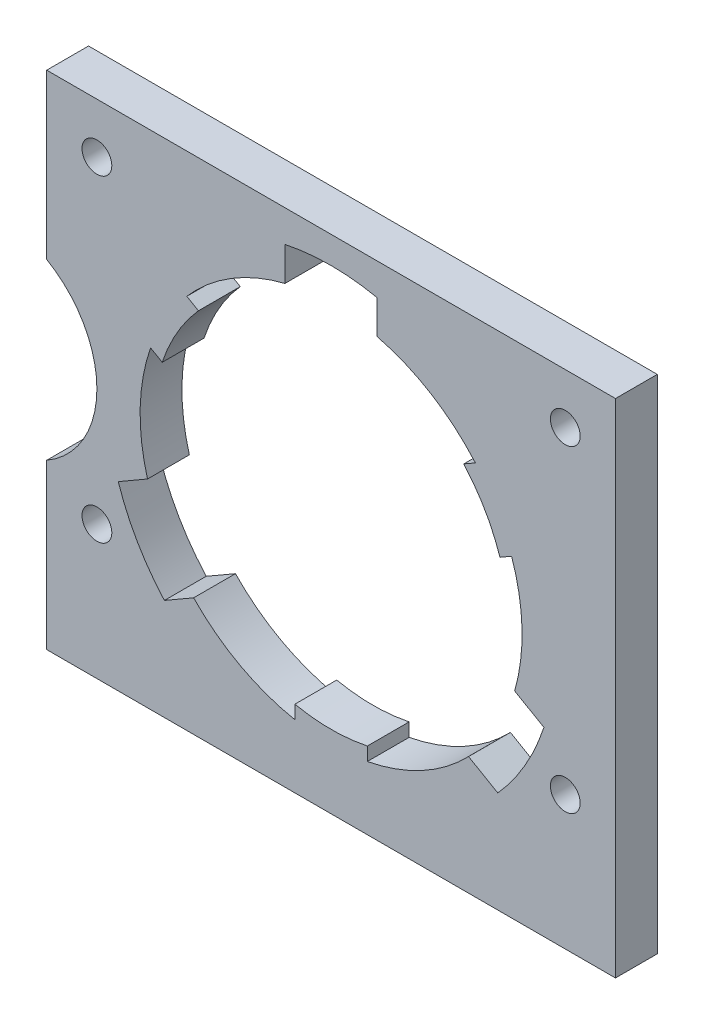
ISO-10303-21;
HEADER;
FILE_DESCRIPTION(('STEP AP214'),'2;1');
FILE_NAME('part.step','',(''),(''),'','','');
FILE_SCHEMA(('AUTOMOTIVE_DESIGN { 1 0 10303 214 1 1 1 1 }'));
ENDSEC;
DATA;
#1=APPLICATION_CONTEXT('core data for automotive mechanical design processes');
#2=APPLICATION_PROTOCOL_DEFINITION('international standard','automotive_design',2000,#1);
#3=PRODUCT_CONTEXT('',#1,'mechanical');
#4=PRODUCT('Part','Part','',(#3));
#5=PRODUCT_RELATED_PRODUCT_CATEGORY('part','',(#4));
#6=PRODUCT_DEFINITION_FORMATION('','',#4);
#7=PRODUCT_DEFINITION_CONTEXT('part definition',#1,'design');
#8=PRODUCT_DEFINITION('design','',#6,#7);
#9=PRODUCT_DEFINITION_SHAPE('','',#8);
#10=(LENGTH_UNIT() NAMED_UNIT(*) SI_UNIT(.MILLI.,.METRE.));
#11=(NAMED_UNIT(*) PLANE_ANGLE_UNIT() SI_UNIT($,.RADIAN.));
#12=(NAMED_UNIT(*) SI_UNIT($,.STERADIAN.) SOLID_ANGLE_UNIT());
#13=UNCERTAINTY_MEASURE_WITH_UNIT(LENGTH_MEASURE(1.E-05),#10,'distance_accuracy_value','');
#14=(GEOMETRIC_REPRESENTATION_CONTEXT(3) GLOBAL_UNCERTAINTY_ASSIGNED_CONTEXT((#13)) GLOBAL_UNIT_ASSIGNED_CONTEXT((#10,
#11,#12)) REPRESENTATION_CONTEXT('',''));
#15=CARTESIAN_POINT('',(0.,0.,0.));
#16=DIRECTION('',(0.,0.,1.));
#17=DIRECTION('',(1.,0.,0.));
#18=AXIS2_PLACEMENT_3D('',#15,#16,#17);
#19=CARTESIAN_POINT('',(0.,0.,3.175));
#20=DIRECTION('',(0.,0.,1.));
#21=DIRECTION('',(1.,0.,0.));
#22=AXIS2_PLACEMENT_3D('',#19,#20,#21);
#23=PLANE('',#22);
#24=CARTESIAN_POINT('',(17.78,15.24,3.175));
#25=DIRECTION('',(0.,0.,-1.));
#26=DIRECTION('',(-1.,0.,0.));
#27=AXIS2_PLACEMENT_3D('',#24,#25,#26);
#28=CIRCLE('',#27,1.1303);
#29=CARTESIAN_POINT('',(16.6497,15.24,3.175));
#30=VERTEX_POINT('',#29);
#31=EDGE_CURVE('E473',#30,#30,#28,.T.);
#32=ORIENTED_EDGE('',*,*,#31,.T.);
#33=EDGE_LOOP('',(#32));
#34=FACE_BOUND('',#33,.T.);
#35=CARTESIAN_POINT('',(17.78,-8.89,3.175));
#36=DIRECTION('',(0.,0.,-1.));
#37=DIRECTION('',(-1.,0.,0.));
#38=AXIS2_PLACEMENT_3D('',#35,#36,#37);
#39=CIRCLE('',#38,1.1303);
#40=CARTESIAN_POINT('',(16.6497,-8.89,3.175));
#41=VERTEX_POINT('',#40);
#42=EDGE_CURVE('E467',#41,#41,#39,.T.);
#43=ORIENTED_EDGE('',*,*,#42,.T.);
#44=EDGE_LOOP('',(#43));
#45=FACE_BOUND('',#44,.T.);
#46=CARTESIAN_POINT('',(-17.78,-8.89,3.175));
#47=DIRECTION('',(0.,0.,-1.));
#48=DIRECTION('',(-1.,0.,0.));
#49=AXIS2_PLACEMENT_3D('',#46,#47,#48);
#50=CIRCLE('',#49,1.1303);
#51=CARTESIAN_POINT('',(-18.9103,-8.89,3.175));
#52=VERTEX_POINT('',#51);
#53=EDGE_CURVE('E461',#52,#52,#50,.T.);
#54=ORIENTED_EDGE('',*,*,#53,.T.);
#55=EDGE_LOOP('',(#54));
#56=FACE_BOUND('',#55,.T.);
#57=DIRECTION('',(0.866025403784443,-0.499999999999992,0.));
#58=VECTOR('',#57,1.);
#59=CARTESIAN_POINT('',(12.657029534224,-11.3489912930525,3.175));
#60=LINE('',#59,#58);
#61=CARTESIAN_POINT('',(10.436057606954,-10.0667125529806,3.175));
#62=VERTEX_POINT('',#61);
#63=CARTESIAN_POINT('',(12.657029534224,-11.3489912930525,3.175));
#64=VERTEX_POINT('',#63);
#65=EDGE_CURVE('E359',#62,#64,#60,.T.);
#66=ORIENTED_EDGE('',*,*,#65,.F.);
#67=CARTESIAN_POINT('',(0.,0.,3.175));
#68=DIRECTION('',(0.,0.,1.));
#69=DIRECTION('',(1.,0.,0.));
#70=AXIS2_PLACEMENT_3D('',#67,#68,#69);
#71=CIRCLE('',#70,14.5);
#72=CARTESIAN_POINT('',(2.74999999999986,-14.2368360249039,3.175));
#73=VERTEX_POINT('',#72);
#74=EDGE_CURVE('E518',#73,#62,#71,.T.);
#75=ORIENTED_EDGE('',*,*,#74,.F.);
#76=DIRECTION('',(0.,1.,0.));
#77=VECTOR('',#76,1.);
#78=CARTESIAN_POINT('',(2.74999999999987,-13.2169398878863,3.175));
#79=LINE('',#78,#77);
#80=CARTESIAN_POINT('',(2.74999999999987,-13.2169398878863,3.175));
#81=VERTEX_POINT('',#80);
#82=EDGE_CURVE('E385',#73,#81,#79,.T.);
#83=ORIENTED_EDGE('',*,*,#82,.T.);
#84=CARTESIAN_POINT('',(0.,0.,3.175));
#85=DIRECTION('',(0.,0.,-1.));
#86=DIRECTION('',(1.,0.,0.));
#87=AXIS2_PLACEMENT_3D('',#84,#85,#86);
#88=CIRCLE('',#87,13.5);
#89=CARTESIAN_POINT('',(-2.75000000000013,-13.2169398878863,3.175));
#90=VERTEX_POINT('',#89);
#91=EDGE_CURVE('E392',#81,#90,#88,.T.);
#92=ORIENTED_EDGE('',*,*,#91,.T.);
#93=DIRECTION('',(0.,-1.,0.));
#94=VECTOR('',#93,1.);
#95=CARTESIAN_POINT('',(-2.75000000000013,-13.2169398878863,3.175));
#96=LINE('',#95,#94);
#97=CARTESIAN_POINT('',(-2.75000000000013,-14.2368360249038,3.175));
#98=VERTEX_POINT('',#97);
#99=EDGE_CURVE('E389',#90,#98,#96,.T.);
#100=ORIENTED_EDGE('',*,*,#99,.T.);
#101=CARTESIAN_POINT('',(-10.4360576069539,-10.0667125529807,3.175));
#102=VERTEX_POINT('',#101);
#103=EDGE_CURVE('E291',#102,#98,#71,.T.);
#104=ORIENTED_EDGE('',*,*,#103,.F.);
#105=DIRECTION('',(0.866025403784436,0.500000000000004,0.));
#106=VECTOR('',#105,1.);
#107=CARTESIAN_POINT('',(-12.6570295342239,-11.3489912930527,3.175));
#108=LINE('',#107,#106);
#109=CARTESIAN_POINT('',(-12.6570295342239,-11.3489912930527,3.175));
#110=VERTEX_POINT('',#109);
#111=EDGE_CURVE('E336',#110,#102,#108,.T.);
#112=ORIENTED_EDGE('',*,*,#111,.F.);
#113=CARTESIAN_POINT('',(0.,0.,3.175));
#114=DIRECTION('',(0.,0.,1.));
#115=DIRECTION('',(-0.500000000000004,0.866025403784436,0.));
#116=AXIS2_PLACEMENT_3D('',#113,#114,#115);
#117=CIRCLE('',#116,17.);
#118=CARTESIAN_POINT('',(-16.1570295342239,-5.2868134665616,3.175));
#119=VERTEX_POINT('',#118);
#120=EDGE_CURVE('E338',#119,#110,#117,.T.);
#121=ORIENTED_EDGE('',*,*,#120,.F.);
#122=DIRECTION('',(-0.866025403784436,-0.500000000000004,0.));
#123=VECTOR('',#122,1.);
#124=CARTESIAN_POINT('',(-16.1570295342239,-5.2868134665616,3.175));
#125=LINE('',#124,#123);
#126=CARTESIAN_POINT('',(-13.9360576069539,-4.00453472648967,3.175));
#127=VERTEX_POINT('',#126);
#128=EDGE_CURVE('E332',#127,#119,#125,.T.);
#129=ORIENTED_EDGE('',*,*,#128,.F.);
#130=CARTESIAN_POINT('',(-13.7044616670802,4.73684815204472,3.175));
#131=VERTEX_POINT('',#130);
#132=EDGE_CURVE('E290',#131,#127,#71,.T.);
#133=ORIENTED_EDGE('',*,*,#132,.F.);
#134=DIRECTION('',(0.866025403784443,-0.499999999999992,0.));
#135=VECTOR('',#134,1.);
#136=CARTESIAN_POINT('',(-12.8212057032014,4.22690008353595,3.175));
#137=LINE('',#136,#135);
#138=CARTESIAN_POINT('',(-12.8212057032014,4.22690008353595,3.175));
#139=VERTEX_POINT('',#138);
#140=EDGE_CURVE('E438',#131,#139,#137,.T.);
#141=ORIENTED_EDGE('',*,*,#140,.T.);
#142=CARTESIAN_POINT('',(0.,0.,3.175));
#143=DIRECTION('',(0.,0.,-1.));
#144=DIRECTION('',(-0.499999999999992,-0.866025403784443,0.));
#145=AXIS2_PLACEMENT_3D('',#142,#143,#144);
#146=CIRCLE('',#145,13.5);
#147=CARTESIAN_POINT('',(-10.0712057032014,8.99003980435036,3.175));
#148=VERTEX_POINT('',#147);
#149=EDGE_CURVE('E445',#139,#148,#146,.T.);
#150=ORIENTED_EDGE('',*,*,#149,.T.);
#151=DIRECTION('',(-0.866025403784443,0.499999999999992,0.));
#152=VECTOR('',#151,1.);
#153=CARTESIAN_POINT('',(-10.0712057032014,8.99003980435036,3.175));
#154=LINE('',#153,#152);
#155=CARTESIAN_POINT('',(-10.9544616670802,9.49998787285913,3.175));
#156=VERTEX_POINT('',#155);
#157=EDGE_CURVE('E442',#148,#156,#154,.T.);
#158=ORIENTED_EDGE('',*,*,#157,.T.);
#159=CARTESIAN_POINT('',(-3.49999999999999,14.0712472794703,3.175));
#160=VERTEX_POINT('',#159);
#161=EDGE_CURVE('E287',#160,#156,#71,.T.);
#162=ORIENTED_EDGE('',*,*,#161,.F.);
#163=DIRECTION('',(0.,-1.,0.));
#164=VECTOR('',#163,1.);
#165=CARTESIAN_POINT('',(-3.5,16.6358047596141,3.175));
#166=LINE('',#165,#164);
#167=CARTESIAN_POINT('',(-3.5,16.6358047596141,3.175));
#168=VERTEX_POINT('',#167);
#169=EDGE_CURVE('E309',#168,#160,#166,.T.);
#170=ORIENTED_EDGE('',*,*,#169,.F.);
#171=CARTESIAN_POINT('',(0.,0.,3.175));
#172=DIRECTION('',(0.,0.,1.));
#173=DIRECTION('',(1.,0.,0.));
#174=AXIS2_PLACEMENT_3D('',#171,#172,#173);
#175=CIRCLE('',#174,17.);
#176=CARTESIAN_POINT('',(3.5,16.6358047596141,3.175));
#177=VERTEX_POINT('',#176);
#178=EDGE_CURVE('E311',#177,#168,#175,.T.);
#179=ORIENTED_EDGE('',*,*,#178,.F.);
#180=DIRECTION('',(0.,1.,0.));
#181=VECTOR('',#180,1.);
#182=CARTESIAN_POINT('',(3.5,16.6358047596141,3.175));
#183=LINE('',#182,#181);
#184=CARTESIAN_POINT('',(3.5,14.0712472794703,3.175));
#185=VERTEX_POINT('',#184);
#186=EDGE_CURVE('E305',#185,#177,#183,.T.);
#187=ORIENTED_EDGE('',*,*,#186,.F.);
#188=CARTESIAN_POINT('',(10.9544616670802,9.49998787285908,3.175));
#189=VERTEX_POINT('',#188);
#190=EDGE_CURVE('E304',#189,#185,#71,.T.);
#191=ORIENTED_EDGE('',*,*,#190,.F.);
#192=DIRECTION('',(-0.866025403784436,-0.500000000000004,0.));
#193=VECTOR('',#192,1.);
#194=CARTESIAN_POINT('',(10.0712057032014,8.99003980435031,3.175));
#195=LINE('',#194,#193);
#196=CARTESIAN_POINT('',(10.0712057032014,8.99003980435031,3.175));
#197=VERTEX_POINT('',#196);
#198=EDGE_CURVE('E412',#189,#197,#195,.T.);
#199=ORIENTED_EDGE('',*,*,#198,.T.);
#200=CARTESIAN_POINT('',(0.,0.,3.175));
#201=DIRECTION('',(0.,0.,-1.));
#202=DIRECTION('',(-0.500000000000004,0.866025403784436,0.));
#203=AXIS2_PLACEMENT_3D('',#200,#201,#202);
#204=CIRCLE('',#203,13.5);
#205=CARTESIAN_POINT('',(12.8212057032014,4.22690008353588,3.175));
#206=VERTEX_POINT('',#205);
#207=EDGE_CURVE('E419',#197,#206,#204,.T.);
#208=ORIENTED_EDGE('',*,*,#207,.T.);
#209=DIRECTION('',(0.866025403784436,0.500000000000004,0.));
#210=VECTOR('',#209,1.);
#211=CARTESIAN_POINT('',(12.8212057032014,4.22690008353588,3.175));
#212=LINE('',#211,#210);
#213=CARTESIAN_POINT('',(13.7044616670802,4.73684815204466,3.175));
#214=VERTEX_POINT('',#213);
#215=EDGE_CURVE('E416',#206,#214,#212,.T.);
#216=ORIENTED_EDGE('',*,*,#215,.T.);
#217=CARTESIAN_POINT('',(13.936057606954,-4.00453472648948,3.175));
#218=VERTEX_POINT('',#217);
#219=EDGE_CURVE('E517',#218,#214,#71,.T.);
#220=ORIENTED_EDGE('',*,*,#219,.F.);
#221=DIRECTION('',(-0.866025403784443,0.499999999999992,0.));
#222=VECTOR('',#221,1.);
#223=CARTESIAN_POINT('',(16.157029534224,-5.28681346656138,3.175));
#224=LINE('',#223,#222);
#225=CARTESIAN_POINT('',(16.157029534224,-5.28681346656138,3.175));
#226=VERTEX_POINT('',#225);
#227=EDGE_CURVE('E363',#226,#218,#224,.T.);
#228=ORIENTED_EDGE('',*,*,#227,.F.);
#229=CARTESIAN_POINT('',(0.,0.,3.175));
#230=DIRECTION('',(0.,0.,1.));
#231=DIRECTION('',(-0.499999999999992,-0.866025403784443,0.));
#232=AXIS2_PLACEMENT_3D('',#229,#230,#231);
#233=CIRCLE('',#232,17.);
#234=EDGE_CURVE('E365',#64,#226,#233,.T.);
#235=ORIENTED_EDGE('',*,*,#234,.F.);
#236=EDGE_LOOP('',(#66,#75,#83,#92,#100,#104,#112,#121,#129,#133,#141,#150,#158,#162,#170,#179,
#187,#191,#199,#208,#216,#220,#228,#235));
#237=FACE_BOUND('',#236,.T.);
#238=CARTESIAN_POINT('',(-25.4,0.,3.175));
#239=DIRECTION('',(0.,0.,1.));
#240=DIRECTION('',(1.,0.,0.));
#241=AXIS2_PLACEMENT_3D('',#238,#239,#240);
#242=CIRCLE('',#241,7.62);
#243=CARTESIAN_POINT('',(-21.59,-6.59911357683742,3.175));
#244=VERTEX_POINT('',#243);
#245=CARTESIAN_POINT('',(-21.59,6.59911357683742,3.175));
#246=VERTEX_POINT('',#245);
#247=EDGE_CURVE('E241',#244,#246,#242,.T.);
#248=ORIENTED_EDGE('',*,*,#247,.F.);
#249=DIRECTION('',(0.,-1.,0.));
#250=VECTOR('',#249,1.);
#251=CARTESIAN_POINT('',(-21.59,19.05,3.175));
#252=LINE('',#251,#250);
#253=CARTESIAN_POINT('',(-21.59,-19.05,3.175));
#254=VERTEX_POINT('',#253);
#255=EDGE_CURVE('E240',#244,#254,#252,.T.);
#256=ORIENTED_EDGE('',*,*,#255,.T.);
#257=DIRECTION('',(1.,0.,0.));
#258=VECTOR('',#257,1.);
#259=CARTESIAN_POINT('',(-21.59,-19.05,3.175));
#260=LINE('',#259,#258);
#261=CARTESIAN_POINT('',(21.59,-19.05,3.175));
#262=VERTEX_POINT('',#261);
#263=EDGE_CURVE('E260',#254,#262,#260,.T.);
#264=ORIENTED_EDGE('',*,*,#263,.T.);
#265=DIRECTION('',(0.,1.,0.));
#266=VECTOR('',#265,1.);
#267=CARTESIAN_POINT('',(21.59,19.05,3.175));
#268=LINE('',#267,#266);
#269=CARTESIAN_POINT('',(21.59,19.05,3.175));
#270=VERTEX_POINT('',#269);
#271=EDGE_CURVE('E255',#262,#270,#268,.T.);
#272=ORIENTED_EDGE('',*,*,#271,.T.);
#273=DIRECTION('',(-1.,0.,0.));
#274=VECTOR('',#273,1.);
#275=CARTESIAN_POINT('',(-21.59,19.05,3.175));
#276=LINE('',#275,#274);
#277=CARTESIAN_POINT('',(-21.59,19.05,3.175));
#278=VERTEX_POINT('',#277);
#279=EDGE_CURVE('E270',#270,#278,#276,.T.);
#280=ORIENTED_EDGE('',*,*,#279,.T.);
#281=EDGE_CURVE('E282',#278,#246,#252,.T.);
#282=ORIENTED_EDGE('',*,*,#281,.T.);
#283=EDGE_LOOP('',(#248,#256,#264,#272,#280,#282));
#284=FACE_BOUND('',#283,.T.);
#285=CARTESIAN_POINT('',(-17.78,15.24,3.175));
#286=DIRECTION('',(0.,0.,-1.));
#287=DIRECTION('',(-1.,0.,0.));
#288=AXIS2_PLACEMENT_3D('',#285,#286,#287);
#289=CIRCLE('',#288,1.1303);
#290=CARTESIAN_POINT('',(-18.9103,15.24,3.175));
#291=VERTEX_POINT('',#290);
#292=EDGE_CURVE('E455',#291,#291,#289,.T.);
#293=ORIENTED_EDGE('',*,*,#292,.T.);
#294=EDGE_LOOP('',(#293));
#295=FACE_BOUND('',#294,.T.);
#296=ADVANCED_FACE('F32',(#34,#45,#56,#237,#284,#295),#23,.T.);
#297=CARTESIAN_POINT('',(-21.59,19.05,3.175));
#298=DIRECTION('',(1.,0.,0.));
#299=DIRECTION('',(0.,1.,0.));
#300=AXIS2_PLACEMENT_3D('',#297,#298,#299);
#301=PLANE('',#300);
#302=DIRECTION('',(0.,-1.,0.));
#303=VECTOR('',#302,1.);
#304=CARTESIAN_POINT('',(-21.59,19.05,0.));
#305=LINE('',#304,#303);
#306=CARTESIAN_POINT('',(-21.59,19.05,0.));
#307=VERTEX_POINT('',#306);
#308=CARTESIAN_POINT('',(-21.59,6.59911357683742,0.));
#309=VERTEX_POINT('',#308);
#310=EDGE_CURVE('E247',#307,#309,#305,.T.);
#311=ORIENTED_EDGE('',*,*,#310,.T.);
#312=DIRECTION('',(0.,0.,1.));
#313=VECTOR('',#312,1.);
#314=CARTESIAN_POINT('',(-21.59,6.59911357683742,0.));
#315=LINE('',#314,#313);
#316=EDGE_CURVE('E47',#309,#246,#315,.T.);
#317=ORIENTED_EDGE('',*,*,#316,.T.);
#318=ORIENTED_EDGE('',*,*,#281,.F.);
#319=DIRECTION('',(0.,0.,-1.));
#320=VECTOR('',#319,1.);
#321=CARTESIAN_POINT('',(-21.59,19.05,3.175));
#322=LINE('',#321,#320);
#323=EDGE_CURVE('E262',#278,#307,#322,.T.);
#324=ORIENTED_EDGE('',*,*,#323,.T.);
#325=EDGE_LOOP('',(#311,#317,#318,#324));
#326=FACE_BOUND('',#325,.T.);
#327=ADVANCED_FACE('F574',(#326),#301,.F.);
#328=CARTESIAN_POINT('',(0.,0.,0.));
#329=DIRECTION('',(0.,0.,1.));
#330=DIRECTION('',(1.,0.,0.));
#331=AXIS2_PLACEMENT_3D('',#328,#329,#330);
#332=CYLINDRICAL_SURFACE('',#331,14.5);
#333=CARTESIAN_POINT('',(0.,0.,0.));
#334=DIRECTION('',(0.,0.,1.));
#335=DIRECTION('',(1.,0.,0.));
#336=AXIS2_PLACEMENT_3D('',#333,#334,#335);
#337=CIRCLE('',#336,14.5);
#338=CARTESIAN_POINT('',(-13.7044616670802,4.73684815204472,0.));
#339=VERTEX_POINT('',#338);
#340=CARTESIAN_POINT('',(-13.9360576069539,-4.00453472648967,0.));
#341=VERTEX_POINT('',#340);
#342=EDGE_CURVE('E277',#339,#341,#337,.T.);
#343=ORIENTED_EDGE('',*,*,#342,.F.);
#344=DIRECTION('',(0.,0.,1.));
#345=VECTOR('',#344,1.);
#346=CARTESIAN_POINT('',(-13.7044616670802,4.73684815204472,0.));
#347=LINE('',#346,#345);
#348=EDGE_CURVE('E434',#339,#131,#347,.T.);
#349=ORIENTED_EDGE('',*,*,#348,.T.);
#350=ORIENTED_EDGE('',*,*,#132,.T.);
#351=DIRECTION('',(0.,0.,1.));
#352=VECTOR('',#351,1.);
#353=CARTESIAN_POINT('',(-13.9360576069539,-4.00453472648967,0.));
#354=LINE('',#353,#352);
#355=EDGE_CURVE('E328',#341,#127,#354,.T.);
#356=ORIENTED_EDGE('',*,*,#355,.F.);
#357=EDGE_LOOP('',(#343,#349,#350,#356));
#358=FACE_BOUND('',#357,.T.);
#359=ADVANCED_FACE('F580',(#358),#332,.F.);
#360=CARTESIAN_POINT('',(10.9544616670802,9.49998787285909,0.));
#361=VERTEX_POINT('',#360);
#362=CARTESIAN_POINT('',(3.5,14.0712472794703,0.));
#363=VERTEX_POINT('',#362);
#364=EDGE_CURVE('E289',#361,#363,#337,.T.);
#365=ORIENTED_EDGE('',*,*,#364,.F.);
#366=DIRECTION('',(0.,0.,1.));
#367=VECTOR('',#366,1.);
#368=CARTESIAN_POINT('',(10.9544616670802,9.49998787285908,0.));
#369=LINE('',#368,#367);
#370=EDGE_CURVE('E408',#361,#189,#369,.T.);
#371=ORIENTED_EDGE('',*,*,#370,.T.);
#372=ORIENTED_EDGE('',*,*,#190,.T.);
#373=DIRECTION('',(0.,0.,1.));
#374=VECTOR('',#373,1.);
#375=CARTESIAN_POINT('',(3.5,14.0712472794703,0.));
#376=LINE('',#375,#374);
#377=EDGE_CURVE('E299',#363,#185,#376,.T.);
#378=ORIENTED_EDGE('',*,*,#377,.F.);
#379=EDGE_LOOP('',(#365,#371,#372,#378));
#380=FACE_BOUND('',#379,.T.);
#381=ADVANCED_FACE('F514',(#380),#332,.F.);
#382=CARTESIAN_POINT('',(2.74999999999986,-14.2368360249039,0.));
#383=VERTEX_POINT('',#382);
#384=CARTESIAN_POINT('',(10.436057606954,-10.0667125529806,0.));
#385=VERTEX_POINT('',#384);
#386=EDGE_CURVE('E499',#383,#385,#337,.T.);
#387=ORIENTED_EDGE('',*,*,#386,.F.);
#388=DIRECTION('',(0.,0.,1.));
#389=VECTOR('',#388,1.);
#390=CARTESIAN_POINT('',(2.74999999999986,-14.2368360249039,0.));
#391=LINE('',#390,#389);
#392=EDGE_CURVE('E381',#383,#73,#391,.T.);
#393=ORIENTED_EDGE('',*,*,#392,.T.);
#394=ORIENTED_EDGE('',*,*,#74,.T.);
#395=DIRECTION('',(0.,0.,1.));
#396=VECTOR('',#395,1.);
#397=CARTESIAN_POINT('',(10.436057606954,-10.0667125529806,0.));
#398=LINE('',#397,#396);
#399=EDGE_CURVE('E355',#385,#62,#398,.T.);
#400=ORIENTED_EDGE('',*,*,#399,.F.);
#401=EDGE_LOOP('',(#387,#393,#394,#400));
#402=FACE_BOUND('',#401,.T.);
#403=ADVANCED_FACE('F542',(#402),#332,.F.);
#404=ORIENTED_EDGE('',*,*,#103,.T.);
#405=DIRECTION('',(0.,0.,1.));
#406=VECTOR('',#405,1.);
#407=CARTESIAN_POINT('',(-2.75000000000013,-14.2368360249038,0.));
#408=LINE('',#407,#406);
#409=CARTESIAN_POINT('',(-2.75000000000013,-14.2368360249038,0.));
#410=VERTEX_POINT('',#409);
#411=EDGE_CURVE('E378',#410,#98,#408,.T.);
#412=ORIENTED_EDGE('',*,*,#411,.F.);
#413=CARTESIAN_POINT('',(-10.4360576069539,-10.0667125529807,0.));
#414=VERTEX_POINT('',#413);
#415=EDGE_CURVE('E279',#414,#410,#337,.T.);
#416=ORIENTED_EDGE('',*,*,#415,.F.);
#417=DIRECTION('',(0.,0.,1.));
#418=VECTOR('',#417,1.);
#419=CARTESIAN_POINT('',(-10.4360576069539,-10.0667125529807,0.));
#420=LINE('',#419,#418);
#421=EDGE_CURVE('E324',#414,#102,#420,.T.);
#422=ORIENTED_EDGE('',*,*,#421,.T.);
#423=EDGE_LOOP('',(#404,#412,#416,#422));
#424=FACE_BOUND('',#423,.T.);
#425=ADVANCED_FACE('F524',(#424),#332,.F.);
#426=ORIENTED_EDGE('',*,*,#161,.T.);
#427=DIRECTION('',(0.,0.,1.));
#428=VECTOR('',#427,1.);
#429=CARTESIAN_POINT('',(-10.9544616670802,9.49998787285913,0.));
#430=LINE('',#429,#428);
#431=CARTESIAN_POINT('',(-10.9544616670802,9.49998787285913,0.));
#432=VERTEX_POINT('',#431);
#433=EDGE_CURVE('E432',#432,#156,#430,.T.);
#434=ORIENTED_EDGE('',*,*,#433,.F.);
#435=CARTESIAN_POINT('',(-3.5,14.0712472794703,0.));
#436=VERTEX_POINT('',#435);
#437=EDGE_CURVE('E275',#436,#432,#337,.T.);
#438=ORIENTED_EDGE('',*,*,#437,.F.);
#439=DIRECTION('',(0.,0.,1.));
#440=VECTOR('',#439,1.);
#441=CARTESIAN_POINT('',(-3.5,14.0712472794703,0.));
#442=LINE('',#441,#440);
#443=EDGE_CURVE('E295',#436,#160,#442,.T.);
#444=ORIENTED_EDGE('',*,*,#443,.T.);
#445=EDGE_LOOP('',(#426,#434,#438,#444));
#446=FACE_BOUND('',#445,.T.);
#447=ADVANCED_FACE('F594',(#446),#332,.F.);
#448=CARTESIAN_POINT('',(21.59,19.05,3.175));
#449=DIRECTION('',(-1.,0.,0.));
#450=DIRECTION('',(0.,0.,1.));
#451=AXIS2_PLACEMENT_3D('',#448,#449,#450);
#452=PLANE('',#451);
#453=DIRECTION('',(0.,1.,0.));
#454=VECTOR('',#453,1.);
#455=CARTESIAN_POINT('',(21.59,19.05,0.));
#456=LINE('',#455,#454);
#457=CARTESIAN_POINT('',(21.59,-19.05,0.));
#458=VERTEX_POINT('',#457);
#459=CARTESIAN_POINT('',(21.59,19.05,0.));
#460=VERTEX_POINT('',#459);
#461=EDGE_CURVE('E250',#458,#460,#456,.T.);
#462=ORIENTED_EDGE('',*,*,#461,.T.);
#463=DIRECTION('',(0.,0.,-1.));
#464=VECTOR('',#463,1.);
#465=CARTESIAN_POINT('',(21.59,19.05,3.175));
#466=LINE('',#465,#464);
#467=EDGE_CURVE('E40',#270,#460,#466,.T.);
#468=ORIENTED_EDGE('',*,*,#467,.F.);
#469=ORIENTED_EDGE('',*,*,#271,.F.);
#470=DIRECTION('',(0.,0.,-1.));
#471=VECTOR('',#470,1.);
#472=CARTESIAN_POINT('',(21.59,-19.05,3.175));
#473=LINE('',#472,#471);
#474=EDGE_CURVE('E256',#262,#458,#473,.T.);
#475=ORIENTED_EDGE('',*,*,#474,.T.);
#476=EDGE_LOOP('',(#462,#468,#469,#475));
#477=FACE_BOUND('',#476,.T.);
#478=ADVANCED_FACE('F34',(#477),#452,.F.);
#479=CARTESIAN_POINT('',(-21.59,19.05,3.175));
#480=DIRECTION('',(0.,-1.,0.));
#481=DIRECTION('',(0.,0.,-1.));
#482=AXIS2_PLACEMENT_3D('',#479,#480,#481);
#483=PLANE('',#482);
#484=DIRECTION('',(-1.,0.,0.));
#485=VECTOR('',#484,1.);
#486=CARTESIAN_POINT('',(-21.59,19.05,0.));
#487=LINE('',#486,#485);
#488=EDGE_CURVE('E248',#460,#307,#487,.T.);
#489=ORIENTED_EDGE('',*,*,#488,.T.);
#490=ORIENTED_EDGE('',*,*,#323,.F.);
#491=ORIENTED_EDGE('',*,*,#279,.F.);
#492=ORIENTED_EDGE('',*,*,#467,.T.);
#493=EDGE_LOOP('',(#489,#490,#491,#492));
#494=FACE_BOUND('',#493,.T.);
#495=ADVANCED_FACE('F268',(#494),#483,.F.);
#496=ORIENTED_EDGE('',*,*,#255,.F.);
#497=DIRECTION('',(0.,0.,1.));
#498=VECTOR('',#497,1.);
#499=CARTESIAN_POINT('',(-21.59,-6.59911357683742,0.));
#500=LINE('',#499,#498);
#501=CARTESIAN_POINT('',(-21.59,-6.59911357683742,0.));
#502=VERTEX_POINT('',#501);
#503=EDGE_CURVE('E228',#244,#502,#500,.F.);
#504=ORIENTED_EDGE('',*,*,#503,.T.);
#505=CARTESIAN_POINT('',(-21.59,-19.05,0.));
#506=VERTEX_POINT('',#505);
#507=EDGE_CURVE('E238',#502,#506,#305,.T.);
#508=ORIENTED_EDGE('',*,*,#507,.T.);
#509=DIRECTION('',(0.,0.,-1.));
#510=VECTOR('',#509,1.);
#511=CARTESIAN_POINT('',(-21.59,-19.05,3.175));
#512=LINE('',#511,#510);
#513=EDGE_CURVE('E259',#254,#506,#512,.T.);
#514=ORIENTED_EDGE('',*,*,#513,.F.);
#515=EDGE_LOOP('',(#496,#504,#508,#514));
#516=FACE_BOUND('',#515,.T.);
#517=ADVANCED_FACE('F236',(#516),#301,.F.);
#518=CARTESIAN_POINT('',(-21.59,-19.05,3.175));
#519=DIRECTION('',(0.,1.,0.));
#520=DIRECTION('',(0.,0.,1.));
#521=AXIS2_PLACEMENT_3D('',#518,#519,#520);
#522=PLANE('',#521);
#523=DIRECTION('',(1.,0.,0.));
#524=VECTOR('',#523,1.);
#525=CARTESIAN_POINT('',(-21.59,-19.05,0.));
#526=LINE('',#525,#524);
#527=EDGE_CURVE('E246',#506,#458,#526,.T.);
#528=ORIENTED_EDGE('',*,*,#527,.T.);
#529=ORIENTED_EDGE('',*,*,#474,.F.);
#530=ORIENTED_EDGE('',*,*,#263,.F.);
#531=ORIENTED_EDGE('',*,*,#513,.T.);
#532=EDGE_LOOP('',(#528,#529,#530,#531));
#533=FACE_BOUND('',#532,.T.);
#534=ADVANCED_FACE('F485',(#533),#522,.F.);
#535=CARTESIAN_POINT('',(0.,0.,0.));
#536=DIRECTION('',(0.,0.,1.));
#537=DIRECTION('',(1.,0.,0.));
#538=AXIS2_PLACEMENT_3D('',#535,#536,#537);
#539=PLANE('',#538);
#540=CARTESIAN_POINT('',(17.78,15.24,0.));
#541=DIRECTION('',(0.,0.,-1.));
#542=DIRECTION('',(-1.,0.,0.));
#543=AXIS2_PLACEMENT_3D('',#540,#541,#542);
#544=CIRCLE('',#543,1.1303);
#545=CARTESIAN_POINT('',(16.6497,15.24,0.));
#546=VERTEX_POINT('',#545);
#547=EDGE_CURVE('E476',#546,#546,#544,.T.);
#548=ORIENTED_EDGE('',*,*,#547,.F.);
#549=EDGE_LOOP('',(#548));
#550=FACE_BOUND('',#549,.T.);
#551=CARTESIAN_POINT('',(17.78,-8.89,0.));
#552=DIRECTION('',(0.,0.,-1.));
#553=DIRECTION('',(-1.,0.,0.));
#554=AXIS2_PLACEMENT_3D('',#551,#552,#553);
#555=CIRCLE('',#554,1.1303);
#556=CARTESIAN_POINT('',(16.6497,-8.89,0.));
#557=VERTEX_POINT('',#556);
#558=EDGE_CURVE('E470',#557,#557,#555,.T.);
#559=ORIENTED_EDGE('',*,*,#558,.F.);
#560=EDGE_LOOP('',(#559));
#561=FACE_BOUND('',#560,.T.);
#562=CARTESIAN_POINT('',(-17.78,-8.89,0.));
#563=DIRECTION('',(0.,0.,-1.));
#564=DIRECTION('',(-1.,0.,0.));
#565=AXIS2_PLACEMENT_3D('',#562,#563,#564);
#566=CIRCLE('',#565,1.1303);
#567=CARTESIAN_POINT('',(-18.9103,-8.89,0.));
#568=VERTEX_POINT('',#567);
#569=EDGE_CURVE('E464',#568,#568,#566,.T.);
#570=ORIENTED_EDGE('',*,*,#569,.F.);
#571=EDGE_LOOP('',(#570));
#572=FACE_BOUND('',#571,.T.);
#573=CARTESIAN_POINT('',(-17.78,15.24,0.));
#574=DIRECTION('',(0.,0.,-1.));
#575=DIRECTION('',(-1.,0.,0.));
#576=AXIS2_PLACEMENT_3D('',#573,#574,#575);
#577=CIRCLE('',#576,1.1303);
#578=CARTESIAN_POINT('',(-18.9103,15.24,0.));
#579=VERTEX_POINT('',#578);
#580=EDGE_CURVE('E458',#579,#579,#577,.T.);
#581=ORIENTED_EDGE('',*,*,#580,.F.);
#582=EDGE_LOOP('',(#581));
#583=FACE_BOUND('',#582,.T.);
#584=ORIENTED_EDGE('',*,*,#415,.T.);
#585=DIRECTION('',(0.,-1.,0.));
#586=VECTOR('',#585,1.);
#587=CARTESIAN_POINT('',(-2.75000000000013,-13.2169398878863,0.));
#588=LINE('',#587,#586);
#589=CARTESIAN_POINT('',(-2.75000000000013,-13.2169398878863,0.));
#590=VERTEX_POINT('',#589);
#591=EDGE_CURVE('E398',#590,#410,#588,.T.);
#592=ORIENTED_EDGE('',*,*,#591,.F.);
#593=CARTESIAN_POINT('',(0.,0.,0.));
#594=DIRECTION('',(0.,0.,-1.));
#595=DIRECTION('',(1.,0.,0.));
#596=AXIS2_PLACEMENT_3D('',#593,#594,#595);
#597=CIRCLE('',#596,13.5);
#598=CARTESIAN_POINT('',(2.74999999999987,-13.2169398878863,0.));
#599=VERTEX_POINT('',#598);
#600=EDGE_CURVE('E388',#599,#590,#597,.T.);
#601=ORIENTED_EDGE('',*,*,#600,.F.);
#602=DIRECTION('',(0.,1.,0.));
#603=VECTOR('',#602,1.);
#604=CARTESIAN_POINT('',(2.74999999999987,-13.2169398878863,0.));
#605=LINE('',#604,#603);
#606=EDGE_CURVE('E379',#383,#599,#605,.T.);
#607=ORIENTED_EDGE('',*,*,#606,.F.);
#608=ORIENTED_EDGE('',*,*,#386,.T.);
#609=DIRECTION('',(0.866025403784443,-0.499999999999992,0.));
#610=VECTOR('',#609,1.);
#611=CARTESIAN_POINT('',(12.657029534224,-11.3489912930525,0.));
#612=LINE('',#611,#610);
#613=CARTESIAN_POINT('',(12.657029534224,-11.3489912930525,0.));
#614=VERTEX_POINT('',#613);
#615=EDGE_CURVE('E352',#385,#614,#612,.T.);
#616=ORIENTED_EDGE('',*,*,#615,.T.);
#617=CARTESIAN_POINT('',(0.,0.,0.));
#618=DIRECTION('',(0.,0.,1.));
#619=DIRECTION('',(-0.499999999999992,-0.866025403784443,0.));
#620=AXIS2_PLACEMENT_3D('',#617,#618,#619);
#621=CIRCLE('',#620,17.);
#622=CARTESIAN_POINT('',(16.157029534224,-5.28681346656138,0.));
#623=VERTEX_POINT('',#622);
#624=EDGE_CURVE('E362',#614,#623,#621,.T.);
#625=ORIENTED_EDGE('',*,*,#624,.T.);
#626=DIRECTION('',(-0.866025403784443,0.499999999999992,0.));
#627=VECTOR('',#626,1.);
#628=CARTESIAN_POINT('',(16.157029534224,-5.28681346656138,0.));
#629=LINE('',#628,#627);
#630=CARTESIAN_POINT('',(13.936057606954,-4.00453472648949,0.));
#631=VERTEX_POINT('',#630);
#632=EDGE_CURVE('E371',#623,#631,#629,.T.);
#633=ORIENTED_EDGE('',*,*,#632,.T.);
#634=CARTESIAN_POINT('',(13.7044616670802,4.73684815204466,0.));
#635=VERTEX_POINT('',#634);
#636=EDGE_CURVE('E500',#631,#635,#337,.T.);
#637=ORIENTED_EDGE('',*,*,#636,.T.);
#638=DIRECTION('',(0.866025403784436,0.500000000000004,0.));
#639=VECTOR('',#638,1.);
#640=CARTESIAN_POINT('',(12.8212057032014,4.22690008353588,0.));
#641=LINE('',#640,#639);
#642=CARTESIAN_POINT('',(12.8212057032014,4.22690008353588,0.));
#643=VERTEX_POINT('',#642);
#644=EDGE_CURVE('E425',#643,#635,#641,.T.);
#645=ORIENTED_EDGE('',*,*,#644,.F.);
#646=CARTESIAN_POINT('',(0.,0.,0.));
#647=DIRECTION('',(0.,0.,-1.));
#648=DIRECTION('',(-0.500000000000004,0.866025403784436,0.));
#649=AXIS2_PLACEMENT_3D('',#646,#647,#648);
#650=CIRCLE('',#649,13.5);
#651=CARTESIAN_POINT('',(10.0712057032014,8.99003980435031,0.));
#652=VERTEX_POINT('',#651);
#653=EDGE_CURVE('E415',#652,#643,#650,.T.);
#654=ORIENTED_EDGE('',*,*,#653,.F.);
#655=DIRECTION('',(-0.866025403784436,-0.500000000000004,0.));
#656=VECTOR('',#655,1.);
#657=CARTESIAN_POINT('',(10.0712057032014,8.99003980435031,0.));
#658=LINE('',#657,#656);
#659=EDGE_CURVE('E405',#361,#652,#658,.T.);
#660=ORIENTED_EDGE('',*,*,#659,.F.);
#661=ORIENTED_EDGE('',*,*,#364,.T.);
#662=DIRECTION('',(0.,1.,0.));
#663=VECTOR('',#662,1.);
#664=CARTESIAN_POINT('',(3.5,16.6358047596141,0.));
#665=LINE('',#664,#663);
#666=CARTESIAN_POINT('',(3.5,16.6358047596141,0.));
#667=VERTEX_POINT('',#666);
#668=EDGE_CURVE('E296',#363,#667,#665,.T.);
#669=ORIENTED_EDGE('',*,*,#668,.T.);
#670=CARTESIAN_POINT('',(0.,0.,0.));
#671=DIRECTION('',(0.,0.,1.));
#672=DIRECTION('',(1.,0.,0.));
#673=AXIS2_PLACEMENT_3D('',#670,#671,#672);
#674=CIRCLE('',#673,17.);
#675=CARTESIAN_POINT('',(-3.5,16.6358047596141,0.));
#676=VERTEX_POINT('',#675);
#677=EDGE_CURVE('E308',#667,#676,#674,.T.);
#678=ORIENTED_EDGE('',*,*,#677,.T.);
#679=DIRECTION('',(0.,-1.,0.));
#680=VECTOR('',#679,1.);
#681=CARTESIAN_POINT('',(-3.5,16.6358047596141,0.));
#682=LINE('',#681,#680);
#683=EDGE_CURVE('E317',#676,#436,#682,.T.);
#684=ORIENTED_EDGE('',*,*,#683,.T.);
#685=ORIENTED_EDGE('',*,*,#437,.T.);
#686=DIRECTION('',(-0.866025403784443,0.499999999999992,0.));
#687=VECTOR('',#686,1.);
#688=CARTESIAN_POINT('',(-10.0712057032014,8.99003980435036,0.));
#689=LINE('',#688,#687);
#690=CARTESIAN_POINT('',(-10.0712057032014,8.99003980435036,0.));
#691=VERTEX_POINT('',#690);
#692=EDGE_CURVE('E449',#691,#432,#689,.T.);
#693=ORIENTED_EDGE('',*,*,#692,.F.);
#694=CARTESIAN_POINT('',(0.,0.,0.));
#695=DIRECTION('',(0.,0.,-1.));
#696=DIRECTION('',(-0.499999999999992,-0.866025403784443,0.));
#697=AXIS2_PLACEMENT_3D('',#694,#695,#696);
#698=CIRCLE('',#697,13.5);
#699=CARTESIAN_POINT('',(-12.8212057032014,4.22690008353595,0.));
#700=VERTEX_POINT('',#699);
#701=EDGE_CURVE('E441',#700,#691,#698,.T.);
#702=ORIENTED_EDGE('',*,*,#701,.F.);
#703=DIRECTION('',(0.866025403784443,-0.499999999999992,0.));
#704=VECTOR('',#703,1.);
#705=CARTESIAN_POINT('',(-12.8212057032014,4.22690008353595,0.));
#706=LINE('',#705,#704);
#707=EDGE_CURVE('E54',#339,#700,#706,.T.);
#708=ORIENTED_EDGE('',*,*,#707,.F.);
#709=ORIENTED_EDGE('',*,*,#342,.T.);
#710=DIRECTION('',(-0.866025403784436,-0.500000000000004,0.));
#711=VECTOR('',#710,1.);
#712=CARTESIAN_POINT('',(-16.1570295342239,-5.2868134665616,0.));
#713=LINE('',#712,#711);
#714=CARTESIAN_POINT('',(-16.1570295342239,-5.2868134665616,0.));
#715=VERTEX_POINT('',#714);
#716=EDGE_CURVE('E325',#341,#715,#713,.T.);
#717=ORIENTED_EDGE('',*,*,#716,.T.);
#718=CARTESIAN_POINT('',(0.,0.,0.));
#719=DIRECTION('',(0.,0.,1.));
#720=DIRECTION('',(-0.500000000000004,0.866025403784436,0.));
#721=AXIS2_PLACEMENT_3D('',#718,#719,#720);
#722=CIRCLE('',#721,17.);
#723=CARTESIAN_POINT('',(-12.6570295342239,-11.3489912930527,0.));
#724=VERTEX_POINT('',#723);
#725=EDGE_CURVE('E335',#715,#724,#722,.T.);
#726=ORIENTED_EDGE('',*,*,#725,.T.);
#727=DIRECTION('',(0.866025403784436,0.500000000000004,0.));
#728=VECTOR('',#727,1.);
#729=CARTESIAN_POINT('',(-12.6570295342239,-11.3489912930527,0.));
#730=LINE('',#729,#728);
#731=EDGE_CURVE('E344',#724,#414,#730,.T.);
#732=ORIENTED_EDGE('',*,*,#731,.T.);
#733=EDGE_LOOP('',(#584,#592,#601,#607,#608,#616,#625,#633,#637,#645,#654,#660,#661,#669,#678,
#684,#685,#693,#702,#708,#709,#717,#726,#732));
#734=FACE_BOUND('',#733,.T.);
#735=ORIENTED_EDGE('',*,*,#507,.F.);
#736=CARTESIAN_POINT('',(-25.4,0.,0.));
#737=DIRECTION('',(0.,0.,1.));
#738=DIRECTION('',(1.,0.,0.));
#739=AXIS2_PLACEMENT_3D('',#736,#737,#738);
#740=CIRCLE('',#739,7.62);
#741=EDGE_CURVE('E11',#502,#309,#740,.T.);
#742=ORIENTED_EDGE('',*,*,#741,.T.);
#743=ORIENTED_EDGE('',*,*,#310,.F.);
#744=ORIENTED_EDGE('',*,*,#488,.F.);
#745=ORIENTED_EDGE('',*,*,#461,.F.);
#746=ORIENTED_EDGE('',*,*,#527,.F.);
#747=EDGE_LOOP('',(#735,#742,#743,#744,#745,#746));
#748=FACE_BOUND('',#747,.T.);
#749=ADVANCED_FACE('F244',(#550,#561,#572,#583,#734,#748),#539,.F.);
#750=ORIENTED_EDGE('',*,*,#219,.T.);
#751=DIRECTION('',(0.,0.,1.));
#752=VECTOR('',#751,1.);
#753=CARTESIAN_POINT('',(13.7044616670802,4.73684815204466,0.));
#754=LINE('',#753,#752);
#755=EDGE_CURVE('E404',#635,#214,#754,.T.);
#756=ORIENTED_EDGE('',*,*,#755,.F.);
#757=ORIENTED_EDGE('',*,*,#636,.F.);
#758=DIRECTION('',(0.,0.,1.));
#759=VECTOR('',#758,1.);
#760=CARTESIAN_POINT('',(13.936057606954,-4.00453472648949,0.));
#761=LINE('',#760,#759);
#762=EDGE_CURVE('E351',#631,#218,#761,.T.);
#763=ORIENTED_EDGE('',*,*,#762,.T.);
#764=EDGE_LOOP('',(#750,#756,#757,#763));
#765=FACE_BOUND('',#764,.T.);
#766=ADVANCED_FACE('F484',(#765),#332,.F.);
#767=CARTESIAN_POINT('',(0.,0.,0.));
#768=DIRECTION('',(0.,0.,1.));
#769=DIRECTION('',(1.,0.,0.));
#770=AXIS2_PLACEMENT_3D('',#767,#768,#769);
#771=CYLINDRICAL_SURFACE('',#770,17.);
#772=ORIENTED_EDGE('',*,*,#178,.T.);
#773=DIRECTION('',(0.,0.,1.));
#774=VECTOR('',#773,1.);
#775=CARTESIAN_POINT('',(-3.5,16.6358047596141,0.));
#776=LINE('',#775,#774);
#777=EDGE_CURVE('E293',#676,#168,#776,.T.);
#778=ORIENTED_EDGE('',*,*,#777,.F.);
#779=ORIENTED_EDGE('',*,*,#677,.F.);
#780=DIRECTION('',(0.,0.,1.));
#781=VECTOR('',#780,1.);
#782=CARTESIAN_POINT('',(3.5,16.6358047596141,0.));
#783=LINE('',#782,#781);
#784=EDGE_CURVE('E302',#667,#177,#783,.T.);
#785=ORIENTED_EDGE('',*,*,#784,.T.);
#786=EDGE_LOOP('',(#772,#778,#779,#785));
#787=FACE_BOUND('',#786,.T.);
#788=ADVANCED_FACE('F603',(#787),#771,.F.);
#789=CARTESIAN_POINT('',(3.5,16.6358047596141,0.));
#790=DIRECTION('',(1.,0.,0.));
#791=DIRECTION('',(0.,0.,-1.));
#792=AXIS2_PLACEMENT_3D('',#789,#790,#791);
#793=PLANE('',#792);
#794=ORIENTED_EDGE('',*,*,#186,.T.);
#795=ORIENTED_EDGE('',*,*,#784,.F.);
#796=ORIENTED_EDGE('',*,*,#668,.F.);
#797=ORIENTED_EDGE('',*,*,#377,.T.);
#798=EDGE_LOOP('',(#794,#795,#796,#797));
#799=FACE_BOUND('',#798,.T.);
#800=ADVANCED_FACE('F511',(#799),#793,.F.);
#801=CARTESIAN_POINT('',(-3.5,16.6358047596141,0.));
#802=DIRECTION('',(-1.,0.,0.));
#803=DIRECTION('',(0.,0.,1.));
#804=AXIS2_PLACEMENT_3D('',#801,#802,#803);
#805=PLANE('',#804);
#806=ORIENTED_EDGE('',*,*,#169,.T.);
#807=ORIENTED_EDGE('',*,*,#443,.F.);
#808=ORIENTED_EDGE('',*,*,#683,.F.);
#809=ORIENTED_EDGE('',*,*,#777,.T.);
#810=EDGE_LOOP('',(#806,#807,#808,#809));
#811=FACE_BOUND('',#810,.T.);
#812=ADVANCED_FACE('F633',(#811),#805,.F.);
#813=CARTESIAN_POINT('',(0.,0.,0.));
#814=DIRECTION('',(0.,0.,1.));
#815=DIRECTION('',(1.,0.,0.));
#816=AXIS2_PLACEMENT_3D('',#813,#814,#815);
#817=CYLINDRICAL_SURFACE('',#816,17.);
#818=ORIENTED_EDGE('',*,*,#120,.T.);
#819=DIRECTION('',(0.,0.,1.));
#820=VECTOR('',#819,1.);
#821=CARTESIAN_POINT('',(-12.6570295342239,-11.3489912930527,0.));
#822=LINE('',#821,#820);
#823=EDGE_CURVE('E322',#724,#110,#822,.T.);
#824=ORIENTED_EDGE('',*,*,#823,.F.);
#825=ORIENTED_EDGE('',*,*,#725,.F.);
#826=DIRECTION('',(0.,0.,1.));
#827=VECTOR('',#826,1.);
#828=CARTESIAN_POINT('',(-16.1570295342239,-5.2868134665616,0.));
#829=LINE('',#828,#827);
#830=EDGE_CURVE('E314',#715,#119,#829,.T.);
#831=ORIENTED_EDGE('',*,*,#830,.T.);
#832=EDGE_LOOP('',(#818,#824,#825,#831));
#833=FACE_BOUND('',#832,.T.);
#834=ADVANCED_FACE('F619',(#833),#817,.F.);
#835=CARTESIAN_POINT('',(-16.1570295342239,-5.2868134665616,0.));
#836=DIRECTION('',(-0.500000000000004,0.866025403784436,0.));
#837=DIRECTION('',(-0.866025403784436,-0.500000000000004,0.));
#838=AXIS2_PLACEMENT_3D('',#835,#836,#837);
#839=PLANE('',#838);
#840=ORIENTED_EDGE('',*,*,#128,.T.);
#841=ORIENTED_EDGE('',*,*,#830,.F.);
#842=ORIENTED_EDGE('',*,*,#716,.F.);
#843=ORIENTED_EDGE('',*,*,#355,.T.);
#844=EDGE_LOOP('',(#840,#841,#842,#843));
#845=FACE_BOUND('',#844,.T.);
#846=ADVANCED_FACE('F615',(#845),#839,.F.);
#847=CARTESIAN_POINT('',(-12.6570295342239,-11.3489912930527,0.));
#848=DIRECTION('',(0.500000000000004,-0.866025403784436,0.));
#849=DIRECTION('',(0.866025403784436,0.500000000000004,0.));
#850=AXIS2_PLACEMENT_3D('',#847,#848,#849);
#851=PLANE('',#850);
#852=ORIENTED_EDGE('',*,*,#111,.T.);
#853=ORIENTED_EDGE('',*,*,#421,.F.);
#854=ORIENTED_EDGE('',*,*,#731,.F.);
#855=ORIENTED_EDGE('',*,*,#823,.T.);
#856=EDGE_LOOP('',(#852,#853,#854,#855));
#857=FACE_BOUND('',#856,.T.);
#858=ADVANCED_FACE('F621',(#857),#851,.F.);
#859=CARTESIAN_POINT('',(0.,0.,0.));
#860=DIRECTION('',(0.,0.,1.));
#861=DIRECTION('',(1.,0.,0.));
#862=AXIS2_PLACEMENT_3D('',#859,#860,#861);
#863=CYLINDRICAL_SURFACE('',#862,17.);
#864=ORIENTED_EDGE('',*,*,#234,.T.);
#865=DIRECTION('',(0.,0.,1.));
#866=VECTOR('',#865,1.);
#867=CARTESIAN_POINT('',(16.157029534224,-5.28681346656138,0.));
#868=LINE('',#867,#866);
#869=EDGE_CURVE('E349',#623,#226,#868,.T.);
#870=ORIENTED_EDGE('',*,*,#869,.F.);
#871=ORIENTED_EDGE('',*,*,#624,.F.);
#872=DIRECTION('',(0.,0.,1.));
#873=VECTOR('',#872,1.);
#874=CARTESIAN_POINT('',(12.657029534224,-11.3489912930525,0.));
#875=LINE('',#874,#873);
#876=EDGE_CURVE('E341',#614,#64,#875,.T.);
#877=ORIENTED_EDGE('',*,*,#876,.T.);
#878=EDGE_LOOP('',(#864,#870,#871,#877));
#879=FACE_BOUND('',#878,.T.);
#880=ADVANCED_FACE('F549',(#879),#863,.F.);
#881=CARTESIAN_POINT('',(12.657029534224,-11.3489912930525,0.));
#882=DIRECTION('',(-0.499999999999992,-0.866025403784443,0.));
#883=DIRECTION('',(0.866025403784443,-0.499999999999992,0.));
#884=AXIS2_PLACEMENT_3D('',#881,#882,#883);
#885=PLANE('',#884);
#886=ORIENTED_EDGE('',*,*,#65,.T.);
#887=ORIENTED_EDGE('',*,*,#876,.F.);
#888=ORIENTED_EDGE('',*,*,#615,.F.);
#889=ORIENTED_EDGE('',*,*,#399,.T.);
#890=EDGE_LOOP('',(#886,#887,#888,#889));
#891=FACE_BOUND('',#890,.T.);
#892=ADVANCED_FACE('F545',(#891),#885,.F.);
#893=CARTESIAN_POINT('',(16.157029534224,-5.28681346656138,0.));
#894=DIRECTION('',(0.499999999999992,0.866025403784443,0.));
#895=DIRECTION('',(-0.866025403784443,0.499999999999992,0.));
#896=AXIS2_PLACEMENT_3D('',#893,#894,#895);
#897=PLANE('',#896);
#898=ORIENTED_EDGE('',*,*,#227,.T.);
#899=ORIENTED_EDGE('',*,*,#762,.F.);
#900=ORIENTED_EDGE('',*,*,#632,.F.);
#901=ORIENTED_EDGE('',*,*,#869,.T.);
#902=EDGE_LOOP('',(#898,#899,#900,#901));
#903=FACE_BOUND('',#902,.T.);
#904=ADVANCED_FACE('F823',(#903),#897,.F.);
#905=CARTESIAN_POINT('',(0.,0.,0.));
#906=DIRECTION('',(0.,0.,1.));
#907=DIRECTION('',(1.,0.,0.));
#908=AXIS2_PLACEMENT_3D('',#905,#906,#907);
#909=CYLINDRICAL_SURFACE('',#908,13.5);
#910=ORIENTED_EDGE('',*,*,#91,.F.);
#911=DIRECTION('',(0.,0.,1.));
#912=VECTOR('',#911,1.);
#913=CARTESIAN_POINT('',(2.74999999999987,-13.2169398878863,0.));
#914=LINE('',#913,#912);
#915=EDGE_CURVE('E368',#599,#81,#914,.T.);
#916=ORIENTED_EDGE('',*,*,#915,.F.);
#917=ORIENTED_EDGE('',*,*,#600,.T.);
#918=DIRECTION('',(0.,0.,1.));
#919=VECTOR('',#918,1.);
#920=CARTESIAN_POINT('',(-2.75000000000013,-13.2169398878863,0.));
#921=LINE('',#920,#919);
#922=EDGE_CURVE('E376',#590,#90,#921,.T.);
#923=ORIENTED_EDGE('',*,*,#922,.T.);
#924=EDGE_LOOP('',(#910,#916,#917,#923));
#925=FACE_BOUND('',#924,.T.);
#926=ADVANCED_FACE('F534',(#925),#909,.F.);
#927=CARTESIAN_POINT('',(2.74999999999987,-13.2169398878863,0.));
#928=DIRECTION('',(1.,0.,0.));
#929=DIRECTION('',(0.,0.,-1.));
#930=AXIS2_PLACEMENT_3D('',#927,#928,#929);
#931=PLANE('',#930);
#932=ORIENTED_EDGE('',*,*,#82,.F.);
#933=ORIENTED_EDGE('',*,*,#392,.F.);
#934=ORIENTED_EDGE('',*,*,#606,.T.);
#935=ORIENTED_EDGE('',*,*,#915,.T.);
#936=EDGE_LOOP('',(#932,#933,#934,#935));
#937=FACE_BOUND('',#936,.T.);
#938=ADVANCED_FACE('F537',(#937),#931,.T.);
#939=CARTESIAN_POINT('',(-2.75000000000013,-13.2169398878863,0.));
#940=DIRECTION('',(-1.,0.,0.));
#941=DIRECTION('',(0.,0.,1.));
#942=AXIS2_PLACEMENT_3D('',#939,#940,#941);
#943=PLANE('',#942);
#944=ORIENTED_EDGE('',*,*,#99,.F.);
#945=ORIENTED_EDGE('',*,*,#922,.F.);
#946=ORIENTED_EDGE('',*,*,#591,.T.);
#947=ORIENTED_EDGE('',*,*,#411,.T.);
#948=EDGE_LOOP('',(#944,#945,#946,#947));
#949=FACE_BOUND('',#948,.T.);
#950=ADVANCED_FACE('F532',(#949),#943,.T.);
#951=CARTESIAN_POINT('',(0.,0.,0.));
#952=DIRECTION('',(0.,0.,1.));
#953=DIRECTION('',(1.,0.,0.));
#954=AXIS2_PLACEMENT_3D('',#951,#952,#953);
#955=CYLINDRICAL_SURFACE('',#954,13.5);
#956=ORIENTED_EDGE('',*,*,#207,.F.);
#957=DIRECTION('',(0.,0.,1.));
#958=VECTOR('',#957,1.);
#959=CARTESIAN_POINT('',(10.0712057032014,8.99003980435031,0.));
#960=LINE('',#959,#958);
#961=EDGE_CURVE('E395',#652,#197,#960,.T.);
#962=ORIENTED_EDGE('',*,*,#961,.F.);
#963=ORIENTED_EDGE('',*,*,#653,.T.);
#964=DIRECTION('',(0.,0.,1.));
#965=VECTOR('',#964,1.);
#966=CARTESIAN_POINT('',(12.8212057032014,4.22690008353588,0.));
#967=LINE('',#966,#965);
#968=EDGE_CURVE('E402',#643,#206,#967,.T.);
#969=ORIENTED_EDGE('',*,*,#968,.T.);
#970=EDGE_LOOP('',(#956,#962,#963,#969));
#971=FACE_BOUND('',#970,.T.);
#972=ADVANCED_FACE('F560',(#971),#955,.F.);
#973=CARTESIAN_POINT('',(10.0712057032014,8.99003980435031,0.));
#974=DIRECTION('',(-0.500000000000004,0.866025403784436,0.));
#975=DIRECTION('',(-0.866025403784436,-0.500000000000004,0.));
#976=AXIS2_PLACEMENT_3D('',#973,#974,#975);
#977=PLANE('',#976);
#978=ORIENTED_EDGE('',*,*,#198,.F.);
#979=ORIENTED_EDGE('',*,*,#370,.F.);
#980=ORIENTED_EDGE('',*,*,#659,.T.);
#981=ORIENTED_EDGE('',*,*,#961,.T.);
#982=EDGE_LOOP('',(#978,#979,#980,#981));
#983=FACE_BOUND('',#982,.T.);
#984=ADVANCED_FACE('F562',(#983),#977,.T.);
#985=CARTESIAN_POINT('',(12.8212057032014,4.22690008353588,0.));
#986=DIRECTION('',(0.500000000000004,-0.866025403784436,0.));
#987=DIRECTION('',(0.866025403784436,0.500000000000004,0.));
#988=AXIS2_PLACEMENT_3D('',#985,#986,#987);
#989=PLANE('',#988);
#990=ORIENTED_EDGE('',*,*,#215,.F.);
#991=ORIENTED_EDGE('',*,*,#968,.F.);
#992=ORIENTED_EDGE('',*,*,#644,.T.);
#993=ORIENTED_EDGE('',*,*,#755,.T.);
#994=EDGE_LOOP('',(#990,#991,#992,#993));
#995=FACE_BOUND('',#994,.T.);
#996=ADVANCED_FACE('F556',(#995),#989,.T.);
#997=CARTESIAN_POINT('',(0.,0.,0.));
#998=DIRECTION('',(0.,0.,1.));
#999=DIRECTION('',(1.,0.,0.));
#1000=AXIS2_PLACEMENT_3D('',#997,#998,#999);
#1001=CYLINDRICAL_SURFACE('',#1000,13.5);
#1002=ORIENTED_EDGE('',*,*,#149,.F.);
#1003=DIRECTION('',(0.,0.,1.));
#1004=VECTOR('',#1003,1.);
#1005=CARTESIAN_POINT('',(-12.8212057032014,4.22690008353595,0.));
#1006=LINE('',#1005,#1004);
#1007=EDGE_CURVE('E422',#700,#139,#1006,.T.);
#1008=ORIENTED_EDGE('',*,*,#1007,.F.);
#1009=ORIENTED_EDGE('',*,*,#701,.T.);
#1010=DIRECTION('',(0.,0.,1.));
#1011=VECTOR('',#1010,1.);
#1012=CARTESIAN_POINT('',(-10.0712057032014,8.99003980435036,0.));
#1013=LINE('',#1012,#1011);
#1014=EDGE_CURVE('E430',#691,#148,#1013,.T.);
#1015=ORIENTED_EDGE('',*,*,#1014,.T.);
#1016=EDGE_LOOP('',(#1002,#1008,#1009,#1015));
#1017=FACE_BOUND('',#1016,.T.);
#1018=ADVANCED_FACE('F569',(#1017),#1001,.F.);
#1019=CARTESIAN_POINT('',(-12.8212057032014,4.22690008353595,0.));
#1020=DIRECTION('',(-0.499999999999992,-0.866025403784443,0.));
#1021=DIRECTION('',(0.866025403784443,-0.499999999999992,0.));
#1022=AXIS2_PLACEMENT_3D('',#1019,#1020,#1021);
#1023=PLANE('',#1022);
#1024=ORIENTED_EDGE('',*,*,#140,.F.);
#1025=ORIENTED_EDGE('',*,*,#348,.F.);
#1026=ORIENTED_EDGE('',*,*,#707,.T.);
#1027=ORIENTED_EDGE('',*,*,#1007,.T.);
#1028=EDGE_LOOP('',(#1024,#1025,#1026,#1027));
#1029=FACE_BOUND('',#1028,.T.);
#1030=ADVANCED_FACE('F653',(#1029),#1023,.T.);
#1031=CARTESIAN_POINT('',(-10.0712057032014,8.99003980435036,0.));
#1032=DIRECTION('',(0.499999999999992,0.866025403784443,0.));
#1033=DIRECTION('',(-0.866025403784443,0.499999999999992,0.));
#1034=AXIS2_PLACEMENT_3D('',#1031,#1032,#1033);
#1035=PLANE('',#1034);
#1036=ORIENTED_EDGE('',*,*,#157,.F.);
#1037=ORIENTED_EDGE('',*,*,#1014,.F.);
#1038=ORIENTED_EDGE('',*,*,#692,.T.);
#1039=ORIENTED_EDGE('',*,*,#433,.T.);
#1040=EDGE_LOOP('',(#1036,#1037,#1038,#1039));
#1041=FACE_BOUND('',#1040,.T.);
#1042=ADVANCED_FACE('F649',(#1041),#1035,.T.);
#1043=CARTESIAN_POINT('',(-25.4,0.,0.));
#1044=DIRECTION('',(0.,0.,1.));
#1045=DIRECTION('',(1.,0.,0.));
#1046=AXIS2_PLACEMENT_3D('',#1043,#1044,#1045);
#1047=CYLINDRICAL_SURFACE('',#1046,7.62);
#1048=ORIENTED_EDGE('',*,*,#741,.F.);
#1049=ORIENTED_EDGE('',*,*,#503,.F.);
#1050=ORIENTED_EDGE('',*,*,#247,.T.);
#1051=ORIENTED_EDGE('',*,*,#316,.F.);
#1052=EDGE_LOOP('',(#1048,#1049,#1050,#1051));
#1053=FACE_BOUND('',#1052,.T.);
#1054=ADVANCED_FACE('F227',(#1053),#1047,.F.);
#1055=CARTESIAN_POINT('',(-17.78,15.24,0.));
#1056=DIRECTION('',(0.,0.,-1.));
#1057=DIRECTION('',(-1.,0.,0.));
#1058=AXIS2_PLACEMENT_3D('',#1055,#1056,#1057);
#1059=CYLINDRICAL_SURFACE('',#1058,1.1303);
#1060=ORIENTED_EDGE('',*,*,#292,.F.);
#1061=EDGE_LOOP('',(#1060));
#1062=FACE_BOUND('',#1061,.T.);
#1063=ORIENTED_EDGE('',*,*,#580,.T.);
#1064=EDGE_LOOP('',(#1063));
#1065=FACE_BOUND('',#1064,.T.);
#1066=ADVANCED_FACE('F664',(#1062,#1065),#1059,.F.);
#1067=CARTESIAN_POINT('',(-17.78,-8.89,0.));
#1068=DIRECTION('',(0.,0.,-1.));
#1069=DIRECTION('',(-1.,0.,0.));
#1070=AXIS2_PLACEMENT_3D('',#1067,#1068,#1069);
#1071=CYLINDRICAL_SURFACE('',#1070,1.1303);
#1072=ORIENTED_EDGE('',*,*,#53,.F.);
#1073=EDGE_LOOP('',(#1072));
#1074=FACE_BOUND('',#1073,.T.);
#1075=ORIENTED_EDGE('',*,*,#569,.T.);
#1076=EDGE_LOOP('',(#1075));
#1077=FACE_BOUND('',#1076,.T.);
#1078=ADVANCED_FACE('F667',(#1074,#1077),#1071,.F.);
#1079=CARTESIAN_POINT('',(17.78,-8.89,0.));
#1080=DIRECTION('',(0.,0.,-1.));
#1081=DIRECTION('',(-1.,0.,0.));
#1082=AXIS2_PLACEMENT_3D('',#1079,#1080,#1081);
#1083=CYLINDRICAL_SURFACE('',#1082,1.1303);
#1084=ORIENTED_EDGE('',*,*,#42,.F.);
#1085=EDGE_LOOP('',(#1084));
#1086=FACE_BOUND('',#1085,.T.);
#1087=ORIENTED_EDGE('',*,*,#558,.T.);
#1088=EDGE_LOOP('',(#1087));
#1089=FACE_BOUND('',#1088,.T.);
#1090=ADVANCED_FACE('F671',(#1086,#1089),#1083,.F.);
#1091=CARTESIAN_POINT('',(17.78,15.24,0.));
#1092=DIRECTION('',(0.,0.,-1.));
#1093=DIRECTION('',(-1.,0.,0.));
#1094=AXIS2_PLACEMENT_3D('',#1091,#1092,#1093);
#1095=CYLINDRICAL_SURFACE('',#1094,1.1303);
#1096=ORIENTED_EDGE('',*,*,#31,.F.);
#1097=EDGE_LOOP('',(#1096));
#1098=FACE_BOUND('',#1097,.T.);
#1099=ORIENTED_EDGE('',*,*,#547,.T.);
#1100=EDGE_LOOP('',(#1099));
#1101=FACE_BOUND('',#1100,.T.);
#1102=ADVANCED_FACE('F480',(#1098,#1101),#1095,.F.);
#1103=CLOSED_SHELL('',(#296,#327,#359,#381,#403,#425,#447,#478,#495,#517,#534,#749,#766,#788,
#800,#812,#834,#846,#858,#880,#892,#904,#926,#938,#950,#972,#984,#996,#1018,#1030,#1042,#1054,
#1066,#1078,#1090,#1102));
#1104=MANIFOLD_SOLID_BREP('B2',#1103);
#1105=ADVANCED_BREP_SHAPE_REPRESENTATION('',(#18,#1104),#14);
#1106=SHAPE_DEFINITION_REPRESENTATION(#9,#1105);
ENDSEC;
END-ISO-10303-21;
